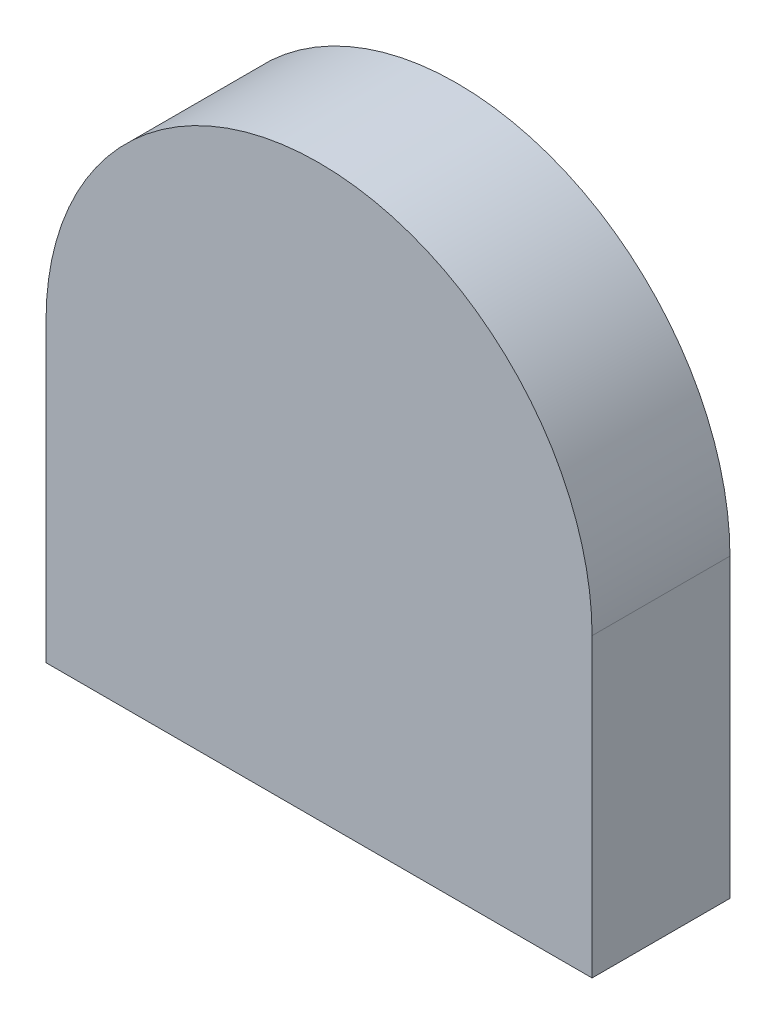
ISO-10303-21;
HEADER;
FILE_DESCRIPTION(('STEP AP214'),'2;1');
FILE_NAME('part.step','',(''),(''),'','','');
FILE_SCHEMA(('AUTOMOTIVE_DESIGN { 1 0 10303 214 1 1 1 1 }'));
ENDSEC;
DATA;
#1=APPLICATION_CONTEXT('core data for automotive mechanical design processes');
#2=APPLICATION_PROTOCOL_DEFINITION('international standard','automotive_design',2000,#1);
#3=PRODUCT_CONTEXT('',#1,'mechanical');
#4=PRODUCT('Part','Part','',(#3));
#5=PRODUCT_RELATED_PRODUCT_CATEGORY('part','',(#4));
#6=PRODUCT_DEFINITION_FORMATION('','',#4);
#7=PRODUCT_DEFINITION_CONTEXT('part definition',#1,'design');
#8=PRODUCT_DEFINITION('design','',#6,#7);
#9=PRODUCT_DEFINITION_SHAPE('','',#8);
#10=(LENGTH_UNIT() NAMED_UNIT(*) SI_UNIT(.MILLI.,.METRE.));
#11=(NAMED_UNIT(*) PLANE_ANGLE_UNIT() SI_UNIT($,.RADIAN.));
#12=(NAMED_UNIT(*) SI_UNIT($,.STERADIAN.) SOLID_ANGLE_UNIT());
#13=UNCERTAINTY_MEASURE_WITH_UNIT(LENGTH_MEASURE(1.E-05),#10,'distance_accuracy_value','');
#14=(GEOMETRIC_REPRESENTATION_CONTEXT(3) GLOBAL_UNCERTAINTY_ASSIGNED_CONTEXT((#13)) GLOBAL_UNIT_ASSIGNED_CONTEXT((#10,
#11,#12)) REPRESENTATION_CONTEXT('',''));
#15=CARTESIAN_POINT('',(0.,0.,0.));
#16=DIRECTION('',(0.,0.,1.));
#17=DIRECTION('',(1.,0.,0.));
#18=AXIS2_PLACEMENT_3D('',#15,#16,#17);
#19=CARTESIAN_POINT('',(0.,0.,10.));
#20=DIRECTION('',(1.,0.,0.));
#21=DIRECTION('',(0.,0.,-1.));
#22=AXIS2_PLACEMENT_3D('',#19,#20,#21);
#23=PLANE('',#22);
#24=DIRECTION('',(0.,-1.,0.));
#25=VECTOR('',#24,1.);
#26=CARTESIAN_POINT('',(0.,0.,0.));
#27=LINE('',#26,#25);
#28=CARTESIAN_POINT('',(0.,21.5,0.));
#29=VERTEX_POINT('',#28);
#30=CARTESIAN_POINT('',(0.,0.,0.));
#31=VERTEX_POINT('',#30);
#32=EDGE_CURVE('E107',#29,#31,#27,.T.);
#33=ORIENTED_EDGE('',*,*,#32,.T.);
#34=DIRECTION('',(0.,0.,-1.));
#35=VECTOR('',#34,1.);
#36=CARTESIAN_POINT('',(0.,0.,10.));
#37=LINE('',#36,#35);
#38=CARTESIAN_POINT('',(0.,0.,10.));
#39=VERTEX_POINT('',#38);
#40=EDGE_CURVE('E11',#39,#31,#37,.T.);
#41=ORIENTED_EDGE('',*,*,#40,.F.);
#42=DIRECTION('',(0.,-1.,0.));
#43=VECTOR('',#42,1.);
#44=CARTESIAN_POINT('',(0.,0.,10.));
#45=LINE('',#44,#43);
#46=CARTESIAN_POINT('',(0.,21.5,10.));
#47=VERTEX_POINT('',#46);
#48=EDGE_CURVE('E91',#47,#39,#45,.T.);
#49=ORIENTED_EDGE('',*,*,#48,.F.);
#50=DIRECTION('',(0.,0.,-1.));
#51=VECTOR('',#50,1.);
#52=CARTESIAN_POINT('',(0.,21.5,10.));
#53=LINE('',#52,#51);
#54=EDGE_CURVE('E103',#47,#29,#53,.T.);
#55=ORIENTED_EDGE('',*,*,#54,.T.);
#56=EDGE_LOOP('',(#33,#41,#49,#55));
#57=FACE_BOUND('',#56,.T.);
#58=ADVANCED_FACE('F39',(#57),#23,.F.);
#59=CARTESIAN_POINT('',(0.,0.,10.));
#60=DIRECTION('',(0.,1.,0.));
#61=DIRECTION('',(0.,0.,1.));
#62=AXIS2_PLACEMENT_3D('',#59,#60,#61);
#63=PLANE('',#62);
#64=DIRECTION('',(1.,0.,0.));
#65=VECTOR('',#64,1.);
#66=CARTESIAN_POINT('',(0.,0.,0.));
#67=LINE('',#66,#65);
#68=CARTESIAN_POINT('',(39.6,0.,0.));
#69=VERTEX_POINT('',#68);
#70=EDGE_CURVE('E96',#31,#69,#67,.T.);
#71=ORIENTED_EDGE('',*,*,#70,.T.);
#72=DIRECTION('',(0.,0.,-1.));
#73=VECTOR('',#72,1.);
#74=CARTESIAN_POINT('',(39.6,0.,10.));
#75=LINE('',#74,#73);
#76=CARTESIAN_POINT('',(39.6,0.,10.));
#77=VERTEX_POINT('',#76);
#78=EDGE_CURVE('E48',#77,#69,#75,.T.);
#79=ORIENTED_EDGE('',*,*,#78,.F.);
#80=DIRECTION('',(1.,0.,0.));
#81=VECTOR('',#80,1.);
#82=CARTESIAN_POINT('',(0.,0.,10.));
#83=LINE('',#82,#81);
#84=EDGE_CURVE('E86',#39,#77,#83,.T.);
#85=ORIENTED_EDGE('',*,*,#84,.F.);
#86=ORIENTED_EDGE('',*,*,#40,.T.);
#87=EDGE_LOOP('',(#71,#79,#85,#86));
#88=FACE_BOUND('',#87,.T.);
#89=ADVANCED_FACE('F95',(#88),#63,.F.);
#90=CARTESIAN_POINT('',(39.6,0.,10.));
#91=DIRECTION('',(-1.,0.,0.));
#92=DIRECTION('',(0.,-1.,0.));
#93=AXIS2_PLACEMENT_3D('',#90,#91,#92);
#94=PLANE('',#93);
#95=DIRECTION('',(0.,1.,0.));
#96=VECTOR('',#95,1.);
#97=CARTESIAN_POINT('',(39.6,0.,0.));
#98=LINE('',#97,#96);
#99=CARTESIAN_POINT('',(39.6,21.5,0.));
#100=VERTEX_POINT('',#99);
#101=EDGE_CURVE('E73',#69,#100,#98,.T.);
#102=ORIENTED_EDGE('',*,*,#101,.T.);
#103=DIRECTION('',(0.,0.,-1.));
#104=VECTOR('',#103,1.);
#105=CARTESIAN_POINT('',(39.6,21.5,10.));
#106=LINE('',#105,#104);
#107=CARTESIAN_POINT('',(39.6,21.5,10.));
#108=VERTEX_POINT('',#107);
#109=EDGE_CURVE('E98',#108,#100,#106,.T.);
#110=ORIENTED_EDGE('',*,*,#109,.F.);
#111=DIRECTION('',(0.,1.,0.));
#112=VECTOR('',#111,1.);
#113=CARTESIAN_POINT('',(39.6,0.,10.));
#114=LINE('',#113,#112);
#115=EDGE_CURVE('E89',#77,#108,#114,.T.);
#116=ORIENTED_EDGE('',*,*,#115,.F.);
#117=ORIENTED_EDGE('',*,*,#78,.T.);
#118=EDGE_LOOP('',(#102,#110,#116,#117));
#119=FACE_BOUND('',#118,.T.);
#120=ADVANCED_FACE('F99',(#119),#94,.F.);
#121=CARTESIAN_POINT('',(19.8,21.5,10.));
#122=DIRECTION('',(0.,0.,-1.));
#123=DIRECTION('',(-1.,0.,0.));
#124=AXIS2_PLACEMENT_3D('',#121,#122,#123);
#125=CYLINDRICAL_SURFACE('',#124,19.8);
#126=CARTESIAN_POINT('',(19.8,21.5,0.));
#127=DIRECTION('',(0.,0.,1.));
#128=DIRECTION('',(-1.,0.,0.));
#129=AXIS2_PLACEMENT_3D('',#126,#127,#128);
#130=CIRCLE('',#129,19.8);
#131=EDGE_CURVE('E79',#100,#29,#130,.T.);
#132=ORIENTED_EDGE('',*,*,#131,.T.);
#133=ORIENTED_EDGE('',*,*,#54,.F.);
#134=CARTESIAN_POINT('',(19.8,21.5,10.));
#135=DIRECTION('',(0.,0.,1.));
#136=DIRECTION('',(-1.,0.,0.));
#137=AXIS2_PLACEMENT_3D('',#134,#135,#136);
#138=CIRCLE('',#137,19.8);
#139=EDGE_CURVE('E56',#108,#47,#138,.T.);
#140=ORIENTED_EDGE('',*,*,#139,.F.);
#141=ORIENTED_EDGE('',*,*,#109,.T.);
#142=EDGE_LOOP('',(#132,#133,#140,#141));
#143=FACE_BOUND('',#142,.T.);
#144=ADVANCED_FACE('F120',(#143),#125,.T.);
#145=CARTESIAN_POINT('',(19.8,21.5,10.));
#146=DIRECTION('',(0.,0.,-1.));
#147=DIRECTION('',(-1.,0.,0.));
#148=AXIS2_PLACEMENT_3D('',#145,#146,#147);
#149=PLANE('',#148);
#150=ORIENTED_EDGE('',*,*,#48,.T.);
#151=ORIENTED_EDGE('',*,*,#84,.T.);
#152=ORIENTED_EDGE('',*,*,#115,.T.);
#153=ORIENTED_EDGE('',*,*,#139,.T.);
#154=EDGE_LOOP('',(#150,#151,#152,#153));
#155=FACE_BOUND('',#154,.T.);
#156=ADVANCED_FACE('F87',(#155),#149,.F.);
#157=CARTESIAN_POINT('',(19.8,21.5,0.));
#158=DIRECTION('',(0.,0.,-1.));
#159=DIRECTION('',(-1.,0.,0.));
#160=AXIS2_PLACEMENT_3D('',#157,#158,#159);
#161=PLANE('',#160);
#162=ORIENTED_EDGE('',*,*,#32,.F.);
#163=ORIENTED_EDGE('',*,*,#131,.F.);
#164=ORIENTED_EDGE('',*,*,#101,.F.);
#165=ORIENTED_EDGE('',*,*,#70,.F.);
#166=EDGE_LOOP('',(#162,#163,#164,#165));
#167=FACE_BOUND('',#166,.T.);
#168=ADVANCED_FACE('F123',(#167),#161,.T.);
#169=CLOSED_SHELL('',(#58,#89,#120,#144,#156,#168));
#170=MANIFOLD_SOLID_BREP('B2',#169);
#171=ADVANCED_BREP_SHAPE_REPRESENTATION('',(#18,#170),#14);
#172=SHAPE_DEFINITION_REPRESENTATION(#9,#171);
ENDSEC;
END-ISO-10303-21;
